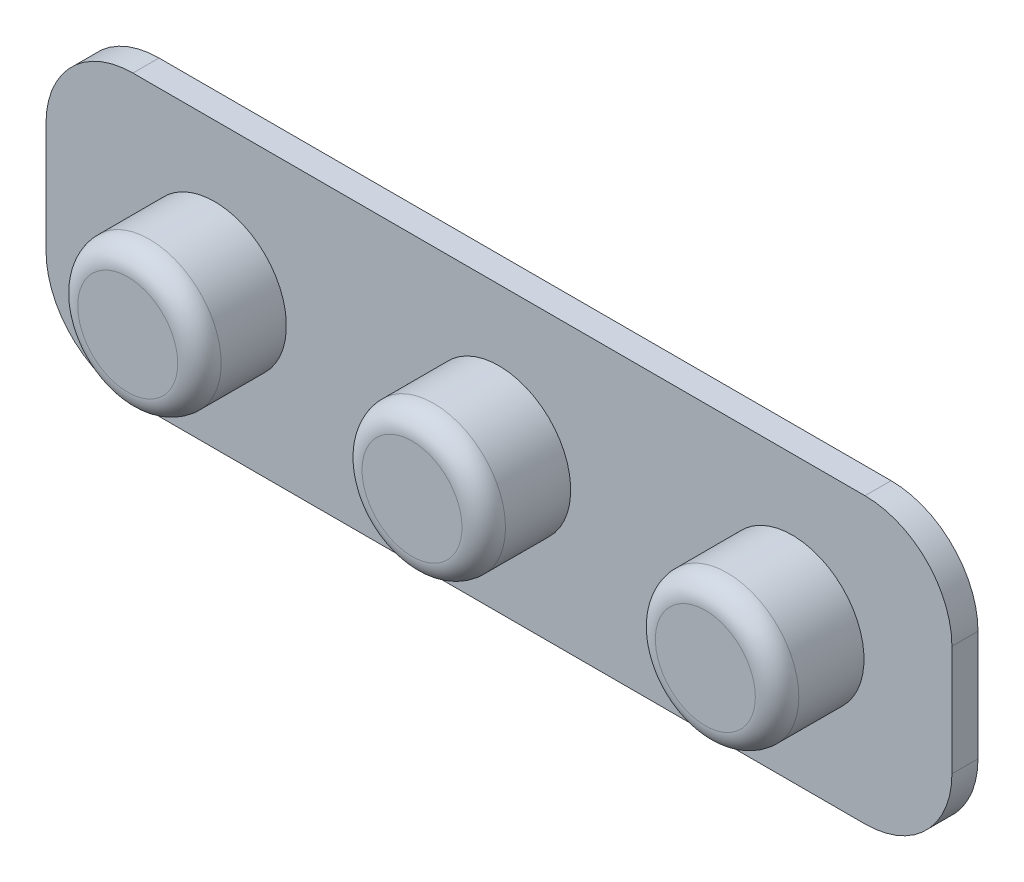
ISO-10303-21;
HEADER;
FILE_DESCRIPTION(('STEP AP214'),'2;1');
FILE_NAME('part.step','',(''),(''),'','','');
FILE_SCHEMA(('AUTOMOTIVE_DESIGN { 1 0 10303 214 1 1 1 1 }'));
ENDSEC;
DATA;
#1=APPLICATION_CONTEXT('core data for automotive mechanical design processes');
#2=APPLICATION_PROTOCOL_DEFINITION('international standard','automotive_design',2000,#1);
#3=PRODUCT_CONTEXT('',#1,'mechanical');
#4=PRODUCT('Part','Part','',(#3));
#5=PRODUCT_RELATED_PRODUCT_CATEGORY('part','',(#4));
#6=PRODUCT_DEFINITION_FORMATION('','',#4);
#7=PRODUCT_DEFINITION_CONTEXT('part definition',#1,'design');
#8=PRODUCT_DEFINITION('design','',#6,#7);
#9=PRODUCT_DEFINITION_SHAPE('','',#8);
#10=(LENGTH_UNIT() NAMED_UNIT(*) SI_UNIT(.MILLI.,.METRE.));
#11=(NAMED_UNIT(*) PLANE_ANGLE_UNIT() SI_UNIT($,.RADIAN.));
#12=(NAMED_UNIT(*) SI_UNIT($,.STERADIAN.) SOLID_ANGLE_UNIT());
#13=UNCERTAINTY_MEASURE_WITH_UNIT(LENGTH_MEASURE(1.E-05),#10,'distance_accuracy_value','');
#14=(GEOMETRIC_REPRESENTATION_CONTEXT(3) GLOBAL_UNCERTAINTY_ASSIGNED_CONTEXT((#13)) GLOBAL_UNIT_ASSIGNED_CONTEXT((#10,
#11,#12)) REPRESENTATION_CONTEXT('',''));
#15=CARTESIAN_POINT('',(0.,0.,0.));
#16=DIRECTION('',(0.,0.,1.));
#17=DIRECTION('',(1.,0.,0.));
#18=AXIS2_PLACEMENT_3D('',#15,#16,#17);
#19=CARTESIAN_POINT('',(0.,-19.9855824928397,3.));
#20=DIRECTION('',(0.,1.,0.));
#21=DIRECTION('',(0.,0.,1.));
#22=AXIS2_PLACEMENT_3D('',#19,#20,#21);
#23=PLANE('',#22);
#24=DIRECTION('',(1.,0.,0.));
#25=VECTOR('',#24,1.);
#26=CARTESIAN_POINT('',(0.,-19.9855824928397,0.));
#27=LINE('',#26,#25);
#28=CARTESIAN_POINT('',(-23.0930099719099,-19.9855824928397,0.));
#29=VERTEX_POINT('',#28);
#30=CARTESIAN_POINT('',(61.1175273121828,-19.9855824928397,0.));
#31=VERTEX_POINT('',#30);
#32=EDGE_CURVE('E428',#29,#31,#27,.T.);
#33=ORIENTED_EDGE('',*,*,#32,.T.);
#34=DIRECTION('',(0.,0.,-1.));
#35=VECTOR('',#34,1.);
#36=CARTESIAN_POINT('',(61.1175273121828,-19.9855824928397,3.));
#37=LINE('',#36,#35);
#38=CARTESIAN_POINT('',(61.1175273121828,-19.9855824928397,3.));
#39=VERTEX_POINT('',#38);
#40=EDGE_CURVE('E154',#31,#39,#37,.F.);
#41=ORIENTED_EDGE('',*,*,#40,.T.);
#42=DIRECTION('',(1.,0.,0.));
#43=VECTOR('',#42,1.);
#44=CARTESIAN_POINT('',(0.,-19.9855824928397,3.));
#45=LINE('',#44,#43);
#46=CARTESIAN_POINT('',(-23.0930099719099,-19.9855824928397,3.));
#47=VERTEX_POINT('',#46);
#48=EDGE_CURVE('E410',#47,#39,#45,.T.);
#49=ORIENTED_EDGE('',*,*,#48,.F.);
#50=DIRECTION('',(0.,0.,-1.));
#51=VECTOR('',#50,1.);
#52=CARTESIAN_POINT('',(-23.0930099719099,-19.9855824928397,3.));
#53=LINE('',#52,#51);
#54=EDGE_CURVE('E151',#47,#29,#53,.T.);
#55=ORIENTED_EDGE('',*,*,#54,.T.);
#56=EDGE_LOOP('',(#33,#41,#49,#55));
#57=FACE_BOUND('',#56,.T.);
#58=ADVANCED_FACE('F39',(#57),#23,.F.);
#59=CARTESIAN_POINT('',(71.1175273121828,0.,3.));
#60=DIRECTION('',(1.,0.,0.));
#61=DIRECTION('',(0.,0.,-1.));
#62=AXIS2_PLACEMENT_3D('',#59,#60,#61);
#63=PLANE('',#62);
#64=DIRECTION('',(0.,-1.,0.));
#65=VECTOR('',#64,1.);
#66=CARTESIAN_POINT('',(71.1175273121828,0.,0.));
#67=LINE('',#66,#65);
#68=CARTESIAN_POINT('',(71.1175273121828,2.7180979499889,0.));
#69=VERTEX_POINT('',#68);
#70=CARTESIAN_POINT('',(71.1175273121828,-9.9855824928397,0.));
#71=VERTEX_POINT('',#70);
#72=EDGE_CURVE('E124',#69,#71,#67,.T.);
#73=ORIENTED_EDGE('',*,*,#72,.F.);
#74=DIRECTION('',(0.,0.,-1.));
#75=VECTOR('',#74,1.);
#76=CARTESIAN_POINT('',(71.1175273121828,2.7180979499889,3.));
#77=LINE('',#76,#75);
#78=CARTESIAN_POINT('',(71.1175273121828,2.7180979499889,3.));
#79=VERTEX_POINT('',#78);
#80=EDGE_CURVE('E142',#69,#79,#77,.F.);
#81=ORIENTED_EDGE('',*,*,#80,.T.);
#82=DIRECTION('',(0.,-1.,0.));
#83=VECTOR('',#82,1.);
#84=CARTESIAN_POINT('',(71.1175273121828,0.,3.));
#85=LINE('',#84,#83);
#86=CARTESIAN_POINT('',(71.1175273121828,-9.9855824928397,3.));
#87=VERTEX_POINT('',#86);
#88=EDGE_CURVE('E419',#79,#87,#85,.T.);
#89=ORIENTED_EDGE('',*,*,#88,.T.);
#90=DIRECTION('',(0.,0.,-1.));
#91=VECTOR('',#90,1.);
#92=CARTESIAN_POINT('',(71.1175273121828,-9.9855824928397,0.));
#93=LINE('',#92,#91);
#94=EDGE_CURVE('E139',#87,#71,#93,.T.);
#95=ORIENTED_EDGE('',*,*,#94,.T.);
#96=EDGE_LOOP('',(#73,#81,#89,#95));
#97=FACE_BOUND('',#96,.T.);
#98=ADVANCED_FACE('F185',(#97),#63,.T.);
#99=CARTESIAN_POINT('',(0.,12.7180979499889,3.));
#100=DIRECTION('',(0.,1.,0.));
#101=DIRECTION('',(0.,0.,1.));
#102=AXIS2_PLACEMENT_3D('',#99,#100,#101);
#103=PLANE('',#102);
#104=DIRECTION('',(1.,0.,0.));
#105=VECTOR('',#104,1.);
#106=CARTESIAN_POINT('',(0.,12.7180979499889,3.));
#107=LINE('',#106,#105);
#108=CARTESIAN_POINT('',(-23.0930099719099,12.7180979499889,3.));
#109=VERTEX_POINT('',#108);
#110=CARTESIAN_POINT('',(61.1175273121828,12.7180979499889,3.));
#111=VERTEX_POINT('',#110);
#112=EDGE_CURVE('E130',#109,#111,#107,.T.);
#113=ORIENTED_EDGE('',*,*,#112,.T.);
#114=DIRECTION('',(0.,0.,-1.));
#115=VECTOR('',#114,1.);
#116=CARTESIAN_POINT('',(61.1175273121828,12.7180979499889,3.));
#117=LINE('',#116,#115);
#118=CARTESIAN_POINT('',(61.1175273121828,12.7180979499889,0.));
#119=VERTEX_POINT('',#118);
#120=EDGE_CURVE('E116',#111,#119,#117,.T.);
#121=ORIENTED_EDGE('',*,*,#120,.T.);
#122=DIRECTION('',(1.,0.,0.));
#123=VECTOR('',#122,1.);
#124=CARTESIAN_POINT('',(0.,12.7180979499889,0.));
#125=LINE('',#124,#123);
#126=CARTESIAN_POINT('',(-23.0930099719099,12.7180979499889,0.));
#127=VERTEX_POINT('',#126);
#128=EDGE_CURVE('E109',#127,#119,#125,.T.);
#129=ORIENTED_EDGE('',*,*,#128,.F.);
#130=DIRECTION('',(0.,0.,-1.));
#131=VECTOR('',#130,1.);
#132=CARTESIAN_POINT('',(-23.0930099719099,12.7180979499889,3.));
#133=LINE('',#132,#131);
#134=EDGE_CURVE('E122',#127,#109,#133,.F.);
#135=ORIENTED_EDGE('',*,*,#134,.T.);
#136=EDGE_LOOP('',(#113,#121,#129,#135));
#137=FACE_BOUND('',#136,.T.);
#138=ADVANCED_FACE('F121',(#137),#103,.T.);
#139=CARTESIAN_POINT('',(-33.0930099719099,0.,3.));
#140=DIRECTION('',(1.,0.,0.));
#141=DIRECTION('',(0.,0.,-1.));
#142=AXIS2_PLACEMENT_3D('',#139,#140,#141);
#143=PLANE('',#142);
#144=DIRECTION('',(0.,-1.,0.));
#145=VECTOR('',#144,1.);
#146=CARTESIAN_POINT('',(-33.0930099719099,0.,0.));
#147=LINE('',#146,#145);
#148=CARTESIAN_POINT('',(-33.0930099719099,2.7180979499889,0.));
#149=VERTEX_POINT('',#148);
#150=CARTESIAN_POINT('',(-33.0930099719099,-9.9855824928397,0.));
#151=VERTEX_POINT('',#150);
#152=EDGE_CURVE('E110',#149,#151,#147,.T.);
#153=ORIENTED_EDGE('',*,*,#152,.T.);
#154=DIRECTION('',(0.,0.,-1.));
#155=VECTOR('',#154,1.);
#156=CARTESIAN_POINT('',(-33.0930099719099,-9.9855824928397,3.));
#157=LINE('',#156,#155);
#158=CARTESIAN_POINT('',(-33.0930099719099,-9.9855824928397,3.));
#159=VERTEX_POINT('',#158);
#160=EDGE_CURVE('E54',#151,#159,#157,.F.);
#161=ORIENTED_EDGE('',*,*,#160,.T.);
#162=DIRECTION('',(0.,-1.,0.));
#163=VECTOR('',#162,1.);
#164=CARTESIAN_POINT('',(-33.0930099719099,0.,3.));
#165=LINE('',#164,#163);
#166=CARTESIAN_POINT('',(-33.0930099719099,2.7180979499889,3.));
#167=VERTEX_POINT('',#166);
#168=EDGE_CURVE('E127',#167,#159,#165,.T.);
#169=ORIENTED_EDGE('',*,*,#168,.F.);
#170=DIRECTION('',(0.,0.,-1.));
#171=VECTOR('',#170,1.);
#172=CARTESIAN_POINT('',(-33.0930099719099,2.7180979499889,0.));
#173=LINE('',#172,#171);
#174=EDGE_CURVE('E156',#167,#149,#173,.T.);
#175=ORIENTED_EDGE('',*,*,#174,.T.);
#176=EDGE_LOOP('',(#153,#161,#169,#175));
#177=FACE_BOUND('',#176,.T.);
#178=ADVANCED_FACE('F245',(#177),#143,.F.);
#179=CARTESIAN_POINT('',(0.,0.,3.));
#180=DIRECTION('',(0.,0.,1.));
#181=DIRECTION('',(1.,0.,0.));
#182=AXIS2_PLACEMENT_3D('',#179,#180,#181);
#183=PLANE('',#182);
#184=CARTESIAN_POINT('',(52.7541511905152,-3.6337422714254,3.));
#185=DIRECTION('',(0.,0.,1.));
#186=DIRECTION('',(1.,0.,0.));
#187=AXIS2_PLACEMENT_3D('',#184,#185,#186);
#188=CIRCLE('',#187,8.25);
#189=CARTESIAN_POINT('',(44.5041511905152,-3.6337422714254,3.));
#190=VERTEX_POINT('',#189);
#191=EDGE_CURVE('E440',#190,#190,#188,.F.);
#192=ORIENTED_EDGE('',*,*,#191,.T.);
#193=EDGE_LOOP('',(#192));
#194=FACE_BOUND('',#193,.T.);
#195=CARTESIAN_POINT('',(19.0122586701365,-3.6337422714254,3.));
#196=DIRECTION('',(0.,0.,1.));
#197=DIRECTION('',(1.,0.,0.));
#198=AXIS2_PLACEMENT_3D('',#195,#196,#197);
#199=CIRCLE('',#198,8.25);
#200=CARTESIAN_POINT('',(10.7622586701365,-3.6337422714254,3.));
#201=VERTEX_POINT('',#200);
#202=EDGE_CURVE('E436',#201,#201,#199,.F.);
#203=ORIENTED_EDGE('',*,*,#202,.T.);
#204=EDGE_LOOP('',(#203));
#205=FACE_BOUND('',#204,.T.);
#206=CARTESIAN_POINT('',(-13.6914217726921,-3.6337422714254,3.));
#207=DIRECTION('',(0.,0.,1.));
#208=DIRECTION('',(1.,0.,0.));
#209=AXIS2_PLACEMENT_3D('',#206,#207,#208);
#210=CIRCLE('',#209,8.25);
#211=CARTESIAN_POINT('',(-21.9414217726921,-3.6337422714254,3.));
#212=VERTEX_POINT('',#211);
#213=EDGE_CURVE('E424',#212,#212,#210,.F.);
#214=ORIENTED_EDGE('',*,*,#213,.T.);
#215=EDGE_LOOP('',(#214));
#216=FACE_BOUND('',#215,.T.);
#217=ORIENTED_EDGE('',*,*,#88,.F.);
#218=CARTESIAN_POINT('',(61.1175273121828,2.7180979499889,3.));
#219=DIRECTION('',(0.,0.,1.));
#220=DIRECTION('',(1.,0.,0.));
#221=AXIS2_PLACEMENT_3D('',#218,#219,#220);
#222=CIRCLE('',#221,10.);
#223=EDGE_CURVE('E149',#79,#111,#222,.T.);
#224=ORIENTED_EDGE('',*,*,#223,.T.);
#225=ORIENTED_EDGE('',*,*,#112,.F.);
#226=CARTESIAN_POINT('',(-23.0930099719099,2.7180979499889,3.));
#227=DIRECTION('',(0.,0.,1.));
#228=DIRECTION('',(1.,0.,0.));
#229=AXIS2_PLACEMENT_3D('',#226,#227,#228);
#230=CIRCLE('',#229,10.);
#231=EDGE_CURVE('E61',#109,#167,#230,.T.);
#232=ORIENTED_EDGE('',*,*,#231,.T.);
#233=ORIENTED_EDGE('',*,*,#168,.T.);
#234=CARTESIAN_POINT('',(-23.0930099719099,-9.9855824928397,3.));
#235=DIRECTION('',(0.,0.,1.));
#236=DIRECTION('',(1.,0.,0.));
#237=AXIS2_PLACEMENT_3D('',#234,#235,#236);
#238=CIRCLE('',#237,10.);
#239=EDGE_CURVE('E145',#159,#47,#238,.T.);
#240=ORIENTED_EDGE('',*,*,#239,.T.);
#241=ORIENTED_EDGE('',*,*,#48,.T.);
#242=CARTESIAN_POINT('',(61.1175273121828,-9.9855824928397,3.));
#243=DIRECTION('',(0.,0.,1.));
#244=DIRECTION('',(1.,0.,0.));
#245=AXIS2_PLACEMENT_3D('',#242,#243,#244);
#246=CIRCLE('',#245,10.);
#247=EDGE_CURVE('E147',#39,#87,#246,.T.);
#248=ORIENTED_EDGE('',*,*,#247,.T.);
#249=EDGE_LOOP('',(#217,#224,#225,#232,#233,#240,#241,#248));
#250=FACE_BOUND('',#249,.T.);
#251=ADVANCED_FACE('F242',(#194,#205,#216,#250),#183,.T.);
#252=CARTESIAN_POINT('',(0.,0.,0.));
#253=DIRECTION('',(0.,0.,1.));
#254=DIRECTION('',(1.,0.,0.));
#255=AXIS2_PLACEMENT_3D('',#252,#253,#254);
#256=PLANE('',#255);
#257=ORIENTED_EDGE('',*,*,#128,.T.);
#258=CARTESIAN_POINT('',(61.1175273121828,2.7180979499889,0.));
#259=DIRECTION('',(0.,0.,1.));
#260=DIRECTION('',(1.,0.,0.));
#261=AXIS2_PLACEMENT_3D('',#258,#259,#260);
#262=CIRCLE('',#261,10.);
#263=EDGE_CURVE('E137',#119,#69,#262,.F.);
#264=ORIENTED_EDGE('',*,*,#263,.T.);
#265=ORIENTED_EDGE('',*,*,#72,.T.);
#266=CARTESIAN_POINT('',(61.1175273121828,-9.9855824928397,0.));
#267=DIRECTION('',(0.,0.,1.));
#268=DIRECTION('',(1.,0.,0.));
#269=AXIS2_PLACEMENT_3D('',#266,#267,#268);
#270=CIRCLE('',#269,10.);
#271=EDGE_CURVE('E135',#71,#31,#270,.F.);
#272=ORIENTED_EDGE('',*,*,#271,.T.);
#273=ORIENTED_EDGE('',*,*,#32,.F.);
#274=CARTESIAN_POINT('',(-23.0930099719099,-9.9855824928397,0.));
#275=DIRECTION('',(0.,0.,1.));
#276=DIRECTION('',(1.,0.,0.));
#277=AXIS2_PLACEMENT_3D('',#274,#275,#276);
#278=CIRCLE('',#277,10.);
#279=EDGE_CURVE('E115',#29,#151,#278,.F.);
#280=ORIENTED_EDGE('',*,*,#279,.T.);
#281=ORIENTED_EDGE('',*,*,#152,.F.);
#282=CARTESIAN_POINT('',(-23.0930099719099,2.7180979499889,0.));
#283=DIRECTION('',(0.,0.,1.));
#284=DIRECTION('',(1.,0.,0.));
#285=AXIS2_PLACEMENT_3D('',#282,#283,#284);
#286=CIRCLE('',#285,10.);
#287=EDGE_CURVE('E106',#149,#127,#286,.F.);
#288=ORIENTED_EDGE('',*,*,#287,.T.);
#289=EDGE_LOOP('',(#257,#264,#265,#272,#273,#280,#281,#288));
#290=FACE_BOUND('',#289,.T.);
#291=ADVANCED_FACE('F108',(#290),#256,.F.);
#292=CARTESIAN_POINT('',(-13.6914217726921,-3.6337422714254,13.));
#293=DIRECTION('',(0.,0.,-1.));
#294=DIRECTION('',(-1.,0.,0.));
#295=AXIS2_PLACEMENT_3D('',#292,#293,#294);
#296=CYLINDRICAL_SURFACE('',#295,8.25);
#297=CARTESIAN_POINT('',(-13.6914217726921,-3.6337422714254,10.5));
#298=DIRECTION('',(0.,0.,1.));
#299=DIRECTION('',(1.,0.,0.));
#300=AXIS2_PLACEMENT_3D('',#297,#298,#299);
#301=CIRCLE('',#300,8.25);
#302=CARTESIAN_POINT('',(-21.9414217726921,-3.6337422714254,10.5));
#303=VERTEX_POINT('',#302);
#304=EDGE_CURVE('E11',#303,#303,#301,.F.);
#305=CARTESIAN_POINT('',(-21.9414217726921,-3.6337422714254,10.5));
#306=CARTESIAN_POINT('',(-21.9414217726921,-3.6337422714254,10.421875));
#307=CARTESIAN_POINT('',(-21.9414217726921,-3.6337422714254,10.34375));
#308=CARTESIAN_POINT('',(-21.9414217726921,-3.6337422714254,10.1875));
#309=CARTESIAN_POINT('',(-21.9414217726921,-3.6337422714254,10.109375));
#310=CARTESIAN_POINT('',(-21.9414217726921,-3.6337422714254,9.953125));
#311=CARTESIAN_POINT('',(-21.9414217726921,-3.6337422714254,9.875));
#312=CARTESIAN_POINT('',(-21.9414217726921,-3.6337422714254,9.71875));
#313=CARTESIAN_POINT('',(-21.9414217726921,-3.6337422714254,9.640625));
#314=CARTESIAN_POINT('',(-21.9414217726921,-3.6337422714254,9.484375));
#315=CARTESIAN_POINT('',(-21.9414217726921,-3.6337422714254,9.40625));
#316=CARTESIAN_POINT('',(-21.9414217726921,-3.6337422714254,9.25));
#317=CARTESIAN_POINT('',(-21.9414217726921,-3.6337422714254,9.171875));
#318=CARTESIAN_POINT('',(-21.9414217726921,-3.6337422714254,9.015625));
#319=CARTESIAN_POINT('',(-21.9414217726921,-3.6337422714254,8.9375));
#320=CARTESIAN_POINT('',(-21.9414217726921,-3.6337422714254,8.78125));
#321=CARTESIAN_POINT('',(-21.9414217726921,-3.6337422714254,8.703125));
#322=CARTESIAN_POINT('',(-21.9414217726921,-3.6337422714254,8.546875));
#323=CARTESIAN_POINT('',(-21.9414217726921,-3.6337422714254,8.46875));
#324=CARTESIAN_POINT('',(-21.9414217726921,-3.6337422714254,8.3125));
#325=CARTESIAN_POINT('',(-21.9414217726921,-3.6337422714254,8.234375));
#326=CARTESIAN_POINT('',(-21.9414217726921,-3.6337422714254,8.078125));
#327=CARTESIAN_POINT('',(-21.9414217726921,-3.6337422714254,8.));
#328=CARTESIAN_POINT('',(-21.9414217726921,-3.6337422714254,7.84375));
#329=CARTESIAN_POINT('',(-21.9414217726921,-3.6337422714254,7.765625));
#330=CARTESIAN_POINT('',(-21.9414217726921,-3.6337422714254,7.609375));
#331=CARTESIAN_POINT('',(-21.9414217726921,-3.6337422714254,7.53125));
#332=CARTESIAN_POINT('',(-21.9414217726921,-3.6337422714254,7.375));
#333=CARTESIAN_POINT('',(-21.9414217726921,-3.6337422714254,7.296875));
#334=CARTESIAN_POINT('',(-21.9414217726921,-3.6337422714254,7.140625));
#335=CARTESIAN_POINT('',(-21.9414217726921,-3.6337422714254,7.0625));
#336=CARTESIAN_POINT('',(-21.9414217726921,-3.6337422714254,6.90625));
#337=CARTESIAN_POINT('',(-21.9414217726921,-3.6337422714254,6.828125));
#338=CARTESIAN_POINT('',(-21.9414217726921,-3.6337422714254,6.671875));
#339=CARTESIAN_POINT('',(-21.9414217726921,-3.6337422714254,6.59375));
#340=CARTESIAN_POINT('',(-21.9414217726921,-3.6337422714254,6.4375));
#341=CARTESIAN_POINT('',(-21.9414217726921,-3.6337422714254,6.359375));
#342=CARTESIAN_POINT('',(-21.9414217726921,-3.6337422714254,6.203125));
#343=CARTESIAN_POINT('',(-21.9414217726921,-3.6337422714254,6.125));
#344=CARTESIAN_POINT('',(-21.9414217726921,-3.6337422714254,5.96875));
#345=CARTESIAN_POINT('',(-21.9414217726921,-3.6337422714254,5.890625));
#346=CARTESIAN_POINT('',(-21.9414217726921,-3.6337422714254,5.734375));
#347=CARTESIAN_POINT('',(-21.9414217726921,-3.6337422714254,5.65625));
#348=CARTESIAN_POINT('',(-21.9414217726921,-3.6337422714254,5.5));
#349=CARTESIAN_POINT('',(-21.9414217726921,-3.6337422714254,5.421875));
#350=CARTESIAN_POINT('',(-21.9414217726921,-3.6337422714254,5.265625));
#351=CARTESIAN_POINT('',(-21.9414217726921,-3.6337422714254,5.1875));
#352=CARTESIAN_POINT('',(-21.9414217726921,-3.6337422714254,5.03125));
#353=CARTESIAN_POINT('',(-21.9414217726921,-3.6337422714254,4.953125));
#354=CARTESIAN_POINT('',(-21.9414217726921,-3.6337422714254,4.796875));
#355=CARTESIAN_POINT('',(-21.9414217726921,-3.6337422714254,4.71875));
#356=CARTESIAN_POINT('',(-21.9414217726921,-3.6337422714254,4.5625));
#357=CARTESIAN_POINT('',(-21.9414217726921,-3.6337422714254,4.484375));
#358=CARTESIAN_POINT('',(-21.9414217726921,-3.6337422714254,4.328125));
#359=CARTESIAN_POINT('',(-21.9414217726921,-3.6337422714254,4.25));
#360=CARTESIAN_POINT('',(-21.9414217726921,-3.6337422714254,4.09375));
#361=CARTESIAN_POINT('',(-21.9414217726921,-3.6337422714254,4.015625));
#362=CARTESIAN_POINT('',(-21.9414217726921,-3.6337422714254,3.859375));
#363=CARTESIAN_POINT('',(-21.9414217726921,-3.6337422714254,3.78125));
#364=CARTESIAN_POINT('',(-21.9414217726921,-3.6337422714254,3.625));
#365=CARTESIAN_POINT('',(-21.9414217726921,-3.6337422714254,3.546875));
#366=CARTESIAN_POINT('',(-21.9414217726921,-3.6337422714254,3.390625));
#367=CARTESIAN_POINT('',(-21.9414217726921,-3.6337422714254,3.3125));
#368=CARTESIAN_POINT('',(-21.9414217726921,-3.6337422714254,3.15625));
#369=CARTESIAN_POINT('',(-21.9414217726921,-3.6337422714254,3.078125));
#370=CARTESIAN_POINT('',(-21.9414217726921,-3.6337422714254,3.));
#371=B_SPLINE_CURVE_WITH_KNOTS('',3,(#305,#306,#307,#308,#309,#310,#311,#312,#313,#314,#315,
#316,#317,#318,#319,#320,#321,#322,#323,#324,#325,#326,#327,#328,#329,#330,#331,#332,#333,#334,
#335,#336,#337,#338,#339,#340,#341,#342,#343,#344,#345,#346,#347,#348,#349,#350,#351,#352,#353,
#354,#355,#356,#357,#358,#359,#360,#361,#362,#363,#364,#365,#366,#367,#368,#369,#370),
.UNSPECIFIED.,.F.,.F.,(4,2,2,2,2,2,2,2,2,2,2,2,2,2,2,2,2,2,2,2,2,2,2,2,2,2,2,2,2,2,2,2,4),(0.,
0.234375,0.468749999999999,0.703124999999999,0.937499999999999,1.171875,1.40625,1.640625,1.875,
2.109375,2.34375,2.578125,2.8125,3.046875,3.28125,3.515625,3.75,3.984375,4.21875,4.453125,
4.6875,4.921875,5.15625,5.390625,5.625,5.859375,6.09375,6.328125,6.5625,6.796875,7.03125,
7.265625,7.5),.UNSPECIFIED.);
#372=EDGE_CURVE('BSEAM238',#303,#212,#371,.T.);
#373=ORIENTED_EDGE('',*,*,#304,.T.);
#374=ORIENTED_EDGE('',*,*,#213,.F.);
#375=ORIENTED_EDGE('',*,*,#372,.T.);
#376=ORIENTED_EDGE('',*,*,#372,.F.);
#377=EDGE_LOOP('',(#373,#375,#374,#376));
#378=FACE_BOUND('',#377,.T.);
#379=ADVANCED_FACE('F238',(#378),#296,.T.);
#380=CARTESIAN_POINT('',(0.,0.,13.));
#381=DIRECTION('',(0.,0.,1.));
#382=DIRECTION('',(1.,0.,0.));
#383=AXIS2_PLACEMENT_3D('',#380,#381,#382);
#384=PLANE('',#383);
#385=CARTESIAN_POINT('',(-13.6914217726921,-3.6337422714254,13.));
#386=DIRECTION('',(0.,0.,1.));
#387=DIRECTION('',(1.,0.,0.));
#388=AXIS2_PLACEMENT_3D('',#385,#386,#387);
#389=CIRCLE('',#388,5.75);
#390=CARTESIAN_POINT('',(-7.94142177269214,-3.6337422714254,13.));
#391=VERTEX_POINT('',#390);
#392=EDGE_CURVE('E47',#391,#391,#389,.T.);
#393=ORIENTED_EDGE('',*,*,#392,.T.);
#394=EDGE_LOOP('',(#393));
#395=FACE_BOUND('',#394,.T.);
#396=ADVANCED_FACE('F173',(#395),#384,.T.);
#397=CARTESIAN_POINT('',(19.0122586701365,-3.6337422714254,13.));
#398=DIRECTION('',(0.,0.,-1.));
#399=DIRECTION('',(-1.,0.,0.));
#400=AXIS2_PLACEMENT_3D('',#397,#398,#399);
#401=CYLINDRICAL_SURFACE('',#400,8.25);
#402=CARTESIAN_POINT('',(19.0122586701365,-3.6337422714254,10.5));
#403=DIRECTION('',(0.,0.,1.));
#404=DIRECTION('',(1.,0.,0.));
#405=AXIS2_PLACEMENT_3D('',#402,#403,#404);
#406=CIRCLE('',#405,8.25);
#407=CARTESIAN_POINT('',(10.7622586701365,-3.6337422714254,10.5));
#408=VERTEX_POINT('',#407);
#409=EDGE_CURVE('E168',#408,#408,#406,.F.);
#410=CARTESIAN_POINT('',(10.7622586701365,-3.6337422714254,10.5));
#411=CARTESIAN_POINT('',(10.7622586701365,-3.6337422714254,10.421875));
#412=CARTESIAN_POINT('',(10.7622586701365,-3.6337422714254,10.34375));
#413=CARTESIAN_POINT('',(10.7622586701365,-3.6337422714254,10.1875));
#414=CARTESIAN_POINT('',(10.7622586701365,-3.6337422714254,10.109375));
#415=CARTESIAN_POINT('',(10.7622586701365,-3.6337422714254,9.953125));
#416=CARTESIAN_POINT('',(10.7622586701365,-3.6337422714254,9.875));
#417=CARTESIAN_POINT('',(10.7622586701365,-3.6337422714254,9.71875));
#418=CARTESIAN_POINT('',(10.7622586701365,-3.6337422714254,9.640625));
#419=CARTESIAN_POINT('',(10.7622586701365,-3.6337422714254,9.484375));
#420=CARTESIAN_POINT('',(10.7622586701365,-3.6337422714254,9.40625));
#421=CARTESIAN_POINT('',(10.7622586701365,-3.6337422714254,9.25));
#422=CARTESIAN_POINT('',(10.7622586701365,-3.6337422714254,9.171875));
#423=CARTESIAN_POINT('',(10.7622586701365,-3.6337422714254,9.015625));
#424=CARTESIAN_POINT('',(10.7622586701365,-3.6337422714254,8.9375));
#425=CARTESIAN_POINT('',(10.7622586701365,-3.6337422714254,8.78125));
#426=CARTESIAN_POINT('',(10.7622586701365,-3.6337422714254,8.703125));
#427=CARTESIAN_POINT('',(10.7622586701365,-3.6337422714254,8.546875));
#428=CARTESIAN_POINT('',(10.7622586701365,-3.6337422714254,8.46875));
#429=CARTESIAN_POINT('',(10.7622586701365,-3.6337422714254,8.3125));
#430=CARTESIAN_POINT('',(10.7622586701365,-3.6337422714254,8.234375));
#431=CARTESIAN_POINT('',(10.7622586701365,-3.6337422714254,8.078125));
#432=CARTESIAN_POINT('',(10.7622586701365,-3.6337422714254,8.));
#433=CARTESIAN_POINT('',(10.7622586701365,-3.6337422714254,7.84375));
#434=CARTESIAN_POINT('',(10.7622586701365,-3.6337422714254,7.765625));
#435=CARTESIAN_POINT('',(10.7622586701365,-3.6337422714254,7.609375));
#436=CARTESIAN_POINT('',(10.7622586701365,-3.6337422714254,7.53125));
#437=CARTESIAN_POINT('',(10.7622586701365,-3.6337422714254,7.375));
#438=CARTESIAN_POINT('',(10.7622586701365,-3.6337422714254,7.296875));
#439=CARTESIAN_POINT('',(10.7622586701365,-3.6337422714254,7.140625));
#440=CARTESIAN_POINT('',(10.7622586701365,-3.6337422714254,7.0625));
#441=CARTESIAN_POINT('',(10.7622586701365,-3.6337422714254,6.90625));
#442=CARTESIAN_POINT('',(10.7622586701365,-3.6337422714254,6.828125));
#443=CARTESIAN_POINT('',(10.7622586701365,-3.6337422714254,6.671875));
#444=CARTESIAN_POINT('',(10.7622586701365,-3.6337422714254,6.59375));
#445=CARTESIAN_POINT('',(10.7622586701365,-3.6337422714254,6.4375));
#446=CARTESIAN_POINT('',(10.7622586701365,-3.6337422714254,6.359375));
#447=CARTESIAN_POINT('',(10.7622586701365,-3.6337422714254,6.203125));
#448=CARTESIAN_POINT('',(10.7622586701365,-3.6337422714254,6.125));
#449=CARTESIAN_POINT('',(10.7622586701365,-3.6337422714254,5.96875));
#450=CARTESIAN_POINT('',(10.7622586701365,-3.6337422714254,5.890625));
#451=CARTESIAN_POINT('',(10.7622586701365,-3.6337422714254,5.734375));
#452=CARTESIAN_POINT('',(10.7622586701365,-3.6337422714254,5.65625));
#453=CARTESIAN_POINT('',(10.7622586701365,-3.6337422714254,5.5));
#454=CARTESIAN_POINT('',(10.7622586701365,-3.6337422714254,5.421875));
#455=CARTESIAN_POINT('',(10.7622586701365,-3.6337422714254,5.265625));
#456=CARTESIAN_POINT('',(10.7622586701365,-3.6337422714254,5.1875));
#457=CARTESIAN_POINT('',(10.7622586701365,-3.6337422714254,5.03125));
#458=CARTESIAN_POINT('',(10.7622586701365,-3.6337422714254,4.953125));
#459=CARTESIAN_POINT('',(10.7622586701365,-3.6337422714254,4.796875));
#460=CARTESIAN_POINT('',(10.7622586701365,-3.6337422714254,4.71875));
#461=CARTESIAN_POINT('',(10.7622586701365,-3.6337422714254,4.5625));
#462=CARTESIAN_POINT('',(10.7622586701365,-3.6337422714254,4.484375));
#463=CARTESIAN_POINT('',(10.7622586701365,-3.6337422714254,4.328125));
#464=CARTESIAN_POINT('',(10.7622586701365,-3.6337422714254,4.25));
#465=CARTESIAN_POINT('',(10.7622586701365,-3.6337422714254,4.09375));
#466=CARTESIAN_POINT('',(10.7622586701365,-3.6337422714254,4.015625));
#467=CARTESIAN_POINT('',(10.7622586701365,-3.6337422714254,3.859375));
#468=CARTESIAN_POINT('',(10.7622586701365,-3.6337422714254,3.78125));
#469=CARTESIAN_POINT('',(10.7622586701365,-3.6337422714254,3.625));
#470=CARTESIAN_POINT('',(10.7622586701365,-3.6337422714254,3.546875));
#471=CARTESIAN_POINT('',(10.7622586701365,-3.6337422714254,3.390625));
#472=CARTESIAN_POINT('',(10.7622586701365,-3.6337422714254,3.3125));
#473=CARTESIAN_POINT('',(10.7622586701365,-3.6337422714254,3.15625));
#474=CARTESIAN_POINT('',(10.7622586701365,-3.6337422714254,3.078125));
#475=CARTESIAN_POINT('',(10.7622586701365,-3.6337422714254,3.));
#476=B_SPLINE_CURVE_WITH_KNOTS('',3,(#410,#411,#412,#413,#414,#415,#416,#417,#418,#419,#420,
#421,#422,#423,#424,#425,#426,#427,#428,#429,#430,#431,#432,#433,#434,#435,#436,#437,#438,#439,
#440,#441,#442,#443,#444,#445,#446,#447,#448,#449,#450,#451,#452,#453,#454,#455,#456,#457,#458,
#459,#460,#461,#462,#463,#464,#465,#466,#467,#468,#469,#470,#471,#472,#473,#474,#475),
.UNSPECIFIED.,.F.,.F.,(4,2,2,2,2,2,2,2,2,2,2,2,2,2,2,2,2,2,2,2,2,2,2,2,2,2,2,2,2,2,2,2,4),(0.,
0.234375,0.468749999999999,0.703124999999999,0.937499999999999,1.171875,1.40625,1.640625,1.875,
2.109375,2.34375,2.578125,2.8125,3.046875,3.28125,3.515625,3.75,3.984375,4.21875,4.453125,
4.6875,4.921875,5.15625,5.390625,5.625,5.859375,6.09375,6.328125,6.5625,6.796875,7.03125,
7.265625,7.5),.UNSPECIFIED.);
#477=EDGE_CURVE('BSEAM231',#408,#201,#476,.T.);
#478=ORIENTED_EDGE('',*,*,#409,.T.);
#479=ORIENTED_EDGE('',*,*,#202,.F.);
#480=ORIENTED_EDGE('',*,*,#477,.T.);
#481=ORIENTED_EDGE('',*,*,#477,.F.);
#482=EDGE_LOOP('',(#478,#480,#479,#481));
#483=FACE_BOUND('',#482,.T.);
#484=ADVANCED_FACE('F231',(#483),#401,.T.);
#485=CARTESIAN_POINT('',(0.,0.,13.));
#486=DIRECTION('',(0.,0.,1.));
#487=DIRECTION('',(1.,0.,0.));
#488=AXIS2_PLACEMENT_3D('',#485,#486,#487);
#489=PLANE('',#488);
#490=CARTESIAN_POINT('',(19.0122586701365,-3.6337422714254,13.));
#491=DIRECTION('',(0.,0.,1.));
#492=DIRECTION('',(1.,0.,0.));
#493=AXIS2_PLACEMENT_3D('',#490,#491,#492);
#494=CIRCLE('',#493,5.75);
#495=CARTESIAN_POINT('',(24.7622586701365,-3.6337422714254,13.));
#496=VERTEX_POINT('',#495);
#497=EDGE_CURVE('E165',#496,#496,#494,.T.);
#498=ORIENTED_EDGE('',*,*,#497,.T.);
#499=EDGE_LOOP('',(#498));
#500=FACE_BOUND('',#499,.T.);
#501=ADVANCED_FACE('F225',(#500),#489,.T.);
#502=CARTESIAN_POINT('',(52.7541511905152,-3.6337422714254,13.));
#503=DIRECTION('',(0.,0.,-1.));
#504=DIRECTION('',(-1.,0.,0.));
#505=AXIS2_PLACEMENT_3D('',#502,#503,#504);
#506=CYLINDRICAL_SURFACE('',#505,8.25);
#507=CARTESIAN_POINT('',(52.7541511905152,-3.6337422714254,10.5));
#508=DIRECTION('',(0.,0.,1.));
#509=DIRECTION('',(1.,0.,0.));
#510=AXIS2_PLACEMENT_3D('',#507,#508,#509);
#511=CIRCLE('',#510,8.25);
#512=CARTESIAN_POINT('',(44.5041511905152,-3.6337422714254,10.5));
#513=VERTEX_POINT('',#512);
#514=EDGE_CURVE('E162',#513,#513,#511,.F.);
#515=CARTESIAN_POINT('',(44.5041511905152,-3.6337422714254,10.5));
#516=CARTESIAN_POINT('',(44.5041511905152,-3.6337422714254,10.421875));
#517=CARTESIAN_POINT('',(44.5041511905152,-3.6337422714254,10.34375));
#518=CARTESIAN_POINT('',(44.5041511905152,-3.6337422714254,10.1875));
#519=CARTESIAN_POINT('',(44.5041511905152,-3.6337422714254,10.109375));
#520=CARTESIAN_POINT('',(44.5041511905152,-3.6337422714254,9.953125));
#521=CARTESIAN_POINT('',(44.5041511905152,-3.6337422714254,9.875));
#522=CARTESIAN_POINT('',(44.5041511905152,-3.6337422714254,9.71875));
#523=CARTESIAN_POINT('',(44.5041511905152,-3.6337422714254,9.640625));
#524=CARTESIAN_POINT('',(44.5041511905152,-3.6337422714254,9.484375));
#525=CARTESIAN_POINT('',(44.5041511905152,-3.6337422714254,9.40625));
#526=CARTESIAN_POINT('',(44.5041511905152,-3.6337422714254,9.25));
#527=CARTESIAN_POINT('',(44.5041511905152,-3.6337422714254,9.171875));
#528=CARTESIAN_POINT('',(44.5041511905152,-3.6337422714254,9.015625));
#529=CARTESIAN_POINT('',(44.5041511905152,-3.6337422714254,8.9375));
#530=CARTESIAN_POINT('',(44.5041511905152,-3.6337422714254,8.78125));
#531=CARTESIAN_POINT('',(44.5041511905152,-3.6337422714254,8.703125));
#532=CARTESIAN_POINT('',(44.5041511905152,-3.6337422714254,8.546875));
#533=CARTESIAN_POINT('',(44.5041511905152,-3.6337422714254,8.46875));
#534=CARTESIAN_POINT('',(44.5041511905152,-3.6337422714254,8.3125));
#535=CARTESIAN_POINT('',(44.5041511905152,-3.6337422714254,8.234375));
#536=CARTESIAN_POINT('',(44.5041511905152,-3.6337422714254,8.078125));
#537=CARTESIAN_POINT('',(44.5041511905152,-3.6337422714254,8.));
#538=CARTESIAN_POINT('',(44.5041511905152,-3.6337422714254,7.84375));
#539=CARTESIAN_POINT('',(44.5041511905152,-3.6337422714254,7.765625));
#540=CARTESIAN_POINT('',(44.5041511905152,-3.6337422714254,7.609375));
#541=CARTESIAN_POINT('',(44.5041511905152,-3.6337422714254,7.53125));
#542=CARTESIAN_POINT('',(44.5041511905152,-3.6337422714254,7.375));
#543=CARTESIAN_POINT('',(44.5041511905152,-3.6337422714254,7.296875));
#544=CARTESIAN_POINT('',(44.5041511905152,-3.6337422714254,7.140625));
#545=CARTESIAN_POINT('',(44.5041511905152,-3.6337422714254,7.0625));
#546=CARTESIAN_POINT('',(44.5041511905152,-3.6337422714254,6.90625));
#547=CARTESIAN_POINT('',(44.5041511905152,-3.6337422714254,6.828125));
#548=CARTESIAN_POINT('',(44.5041511905152,-3.6337422714254,6.671875));
#549=CARTESIAN_POINT('',(44.5041511905152,-3.6337422714254,6.59375));
#550=CARTESIAN_POINT('',(44.5041511905152,-3.6337422714254,6.4375));
#551=CARTESIAN_POINT('',(44.5041511905152,-3.6337422714254,6.359375));
#552=CARTESIAN_POINT('',(44.5041511905152,-3.6337422714254,6.203125));
#553=CARTESIAN_POINT('',(44.5041511905152,-3.6337422714254,6.125));
#554=CARTESIAN_POINT('',(44.5041511905152,-3.6337422714254,5.96875));
#555=CARTESIAN_POINT('',(44.5041511905152,-3.6337422714254,5.890625));
#556=CARTESIAN_POINT('',(44.5041511905152,-3.6337422714254,5.734375));
#557=CARTESIAN_POINT('',(44.5041511905152,-3.6337422714254,5.65625));
#558=CARTESIAN_POINT('',(44.5041511905152,-3.6337422714254,5.5));
#559=CARTESIAN_POINT('',(44.5041511905152,-3.6337422714254,5.421875));
#560=CARTESIAN_POINT('',(44.5041511905152,-3.6337422714254,5.265625));
#561=CARTESIAN_POINT('',(44.5041511905152,-3.6337422714254,5.1875));
#562=CARTESIAN_POINT('',(44.5041511905152,-3.6337422714254,5.03125));
#563=CARTESIAN_POINT('',(44.5041511905152,-3.6337422714254,4.953125));
#564=CARTESIAN_POINT('',(44.5041511905152,-3.6337422714254,4.796875));
#565=CARTESIAN_POINT('',(44.5041511905152,-3.6337422714254,4.71875));
#566=CARTESIAN_POINT('',(44.5041511905152,-3.6337422714254,4.5625));
#567=CARTESIAN_POINT('',(44.5041511905152,-3.6337422714254,4.484375));
#568=CARTESIAN_POINT('',(44.5041511905152,-3.6337422714254,4.328125));
#569=CARTESIAN_POINT('',(44.5041511905152,-3.6337422714254,4.25));
#570=CARTESIAN_POINT('',(44.5041511905152,-3.6337422714254,4.09375));
#571=CARTESIAN_POINT('',(44.5041511905152,-3.6337422714254,4.015625));
#572=CARTESIAN_POINT('',(44.5041511905152,-3.6337422714254,3.859375));
#573=CARTESIAN_POINT('',(44.5041511905152,-3.6337422714254,3.78125));
#574=CARTESIAN_POINT('',(44.5041511905152,-3.6337422714254,3.625));
#575=CARTESIAN_POINT('',(44.5041511905152,-3.6337422714254,3.546875));
#576=CARTESIAN_POINT('',(44.5041511905152,-3.6337422714254,3.390625));
#577=CARTESIAN_POINT('',(44.5041511905152,-3.6337422714254,3.3125));
#578=CARTESIAN_POINT('',(44.5041511905152,-3.6337422714254,3.15625));
#579=CARTESIAN_POINT('',(44.5041511905152,-3.6337422714254,3.078125));
#580=CARTESIAN_POINT('',(44.5041511905152,-3.6337422714254,3.));
#581=B_SPLINE_CURVE_WITH_KNOTS('',3,(#515,#516,#517,#518,#519,#520,#521,#522,#523,#524,#525,
#526,#527,#528,#529,#530,#531,#532,#533,#534,#535,#536,#537,#538,#539,#540,#541,#542,#543,#544,
#545,#546,#547,#548,#549,#550,#551,#552,#553,#554,#555,#556,#557,#558,#559,#560,#561,#562,#563,
#564,#565,#566,#567,#568,#569,#570,#571,#572,#573,#574,#575,#576,#577,#578,#579,#580),
.UNSPECIFIED.,.F.,.F.,(4,2,2,2,2,2,2,2,2,2,2,2,2,2,2,2,2,2,2,2,2,2,2,2,2,2,2,2,2,2,2,2,4),(0.,
0.234375,0.468749999999999,0.703124999999999,0.937499999999999,1.171875,1.40625,1.640625,1.875,
2.109375,2.34375,2.578125,2.8125,3.046875,3.28125,3.515625,3.75,3.984375,4.21875,4.453125,
4.6875,4.921875,5.15625,5.390625,5.625,5.859375,6.09375,6.328125,6.5625,6.796875,7.03125,
7.265625,7.5),.UNSPECIFIED.);
#582=EDGE_CURVE('BSEAM220',#513,#190,#581,.T.);
#583=ORIENTED_EDGE('',*,*,#514,.T.);
#584=ORIENTED_EDGE('',*,*,#191,.F.);
#585=ORIENTED_EDGE('',*,*,#582,.T.);
#586=ORIENTED_EDGE('',*,*,#582,.F.);
#587=EDGE_LOOP('',(#583,#585,#584,#586));
#588=FACE_BOUND('',#587,.T.);
#589=ADVANCED_FACE('F220',(#588),#506,.T.);
#590=CARTESIAN_POINT('',(0.,0.,13.));
#591=DIRECTION('',(0.,0.,1.));
#592=DIRECTION('',(1.,0.,0.));
#593=AXIS2_PLACEMENT_3D('',#590,#591,#592);
#594=PLANE('',#593);
#595=CARTESIAN_POINT('',(52.7541511905152,-3.6337422714254,13.));
#596=DIRECTION('',(0.,0.,1.));
#597=DIRECTION('',(1.,0.,0.));
#598=AXIS2_PLACEMENT_3D('',#595,#596,#597);
#599=CIRCLE('',#598,5.75);
#600=CARTESIAN_POINT('',(58.5041511905152,-3.6337422714254,13.));
#601=VERTEX_POINT('',#600);
#602=EDGE_CURVE('E159',#601,#601,#599,.T.);
#603=ORIENTED_EDGE('',*,*,#602,.T.);
#604=EDGE_LOOP('',(#603));
#605=FACE_BOUND('',#604,.T.);
#606=ADVANCED_FACE('F200',(#605),#594,.T.);
#607=CARTESIAN_POINT('',(61.1175273121828,2.7180979499889,3.));
#608=DIRECTION('',(0.,0.,-1.));
#609=DIRECTION('',(-1.,0.,0.));
#610=AXIS2_PLACEMENT_3D('',#607,#608,#609);
#611=CYLINDRICAL_SURFACE('',#610,10.);
#612=ORIENTED_EDGE('',*,*,#223,.F.);
#613=ORIENTED_EDGE('',*,*,#80,.F.);
#614=ORIENTED_EDGE('',*,*,#263,.F.);
#615=ORIENTED_EDGE('',*,*,#120,.F.);
#616=EDGE_LOOP('',(#612,#613,#614,#615));
#617=FACE_BOUND('',#616,.T.);
#618=ADVANCED_FACE('F196',(#617),#611,.T.);
#619=CARTESIAN_POINT('',(61.1175273121828,-9.9855824928397,3.));
#620=DIRECTION('',(0.,0.,1.));
#621=DIRECTION('',(1.,0.,0.));
#622=AXIS2_PLACEMENT_3D('',#619,#620,#621);
#623=CYLINDRICAL_SURFACE('',#622,10.);
#624=ORIENTED_EDGE('',*,*,#247,.F.);
#625=ORIENTED_EDGE('',*,*,#40,.F.);
#626=ORIENTED_EDGE('',*,*,#271,.F.);
#627=ORIENTED_EDGE('',*,*,#94,.F.);
#628=EDGE_LOOP('',(#624,#625,#626,#627));
#629=FACE_BOUND('',#628,.T.);
#630=ADVANCED_FACE('F199',(#629),#623,.T.);
#631=CARTESIAN_POINT('',(-23.0930099719099,-9.9855824928397,3.));
#632=DIRECTION('',(0.,0.,-1.));
#633=DIRECTION('',(-1.,0.,0.));
#634=AXIS2_PLACEMENT_3D('',#631,#632,#633);
#635=CYLINDRICAL_SURFACE('',#634,10.);
#636=ORIENTED_EDGE('',*,*,#239,.F.);
#637=ORIENTED_EDGE('',*,*,#160,.F.);
#638=ORIENTED_EDGE('',*,*,#279,.F.);
#639=ORIENTED_EDGE('',*,*,#54,.F.);
#640=EDGE_LOOP('',(#636,#637,#638,#639));
#641=FACE_BOUND('',#640,.T.);
#642=ADVANCED_FACE('F204',(#641),#635,.T.);
#643=CARTESIAN_POINT('',(-23.0930099719099,2.7180979499889,3.));
#644=DIRECTION('',(0.,0.,1.));
#645=DIRECTION('',(1.,0.,0.));
#646=AXIS2_PLACEMENT_3D('',#643,#644,#645);
#647=CYLINDRICAL_SURFACE('',#646,10.);
#648=ORIENTED_EDGE('',*,*,#231,.F.);
#649=ORIENTED_EDGE('',*,*,#134,.F.);
#650=ORIENTED_EDGE('',*,*,#287,.F.);
#651=ORIENTED_EDGE('',*,*,#174,.F.);
#652=EDGE_LOOP('',(#648,#649,#650,#651));
#653=FACE_BOUND('',#652,.T.);
#654=ADVANCED_FACE('F126',(#653),#647,.T.);
#655=CARTESIAN_POINT('',(52.7541511905152,-3.6337422714254,10.5));
#656=DIRECTION('',(0.,0.,1.));
#657=DIRECTION('',(1.,0.,0.));
#658=AXIS2_PLACEMENT_3D('',#655,#656,#657);
#659=TOROIDAL_SURFACE('',#658,5.75,2.5);
#660=ORIENTED_EDGE('',*,*,#514,.F.);
#661=EDGE_LOOP('',(#660));
#662=FACE_BOUND('',#661,.T.);
#663=ORIENTED_EDGE('',*,*,#602,.F.);
#664=EDGE_LOOP('',(#663));
#665=FACE_BOUND('',#664,.T.);
#666=ADVANCED_FACE('F181',(#662,#665),#659,.T.);
#667=CARTESIAN_POINT('',(19.0122586701365,-3.6337422714254,10.5));
#668=DIRECTION('',(0.,0.,1.));
#669=DIRECTION('',(1.,0.,0.));
#670=AXIS2_PLACEMENT_3D('',#667,#668,#669);
#671=TOROIDAL_SURFACE('',#670,5.75,2.5);
#672=ORIENTED_EDGE('',*,*,#409,.F.);
#673=EDGE_LOOP('',(#672));
#674=FACE_BOUND('',#673,.T.);
#675=ORIENTED_EDGE('',*,*,#497,.F.);
#676=EDGE_LOOP('',(#675));
#677=FACE_BOUND('',#676,.T.);
#678=ADVANCED_FACE('F176',(#674,#677),#671,.T.);
#679=CARTESIAN_POINT('',(-13.6914217726921,-3.6337422714254,10.5));
#680=DIRECTION('',(0.,0.,1.));
#681=DIRECTION('',(1.,0.,0.));
#682=AXIS2_PLACEMENT_3D('',#679,#680,#681);
#683=TOROIDAL_SURFACE('',#682,5.75,2.5);
#684=ORIENTED_EDGE('',*,*,#304,.F.);
#685=EDGE_LOOP('',(#684));
#686=FACE_BOUND('',#685,.T.);
#687=ORIENTED_EDGE('',*,*,#392,.F.);
#688=EDGE_LOOP('',(#687));
#689=FACE_BOUND('',#688,.T.);
#690=ADVANCED_FACE('F41',(#686,#689),#683,.T.);
#691=CLOSED_SHELL('',(#58,#98,#138,#178,#251,#291,#379,#396,#484,#501,#589,#606,#618,#630,#642,
#654,#666,#678,#690));
#692=MANIFOLD_SOLID_BREP('B2',#691);
#693=ADVANCED_BREP_SHAPE_REPRESENTATION('',(#18,#692),#14);
#694=SHAPE_DEFINITION_REPRESENTATION(#9,#693);
ENDSEC;
END-ISO-10303-21;
